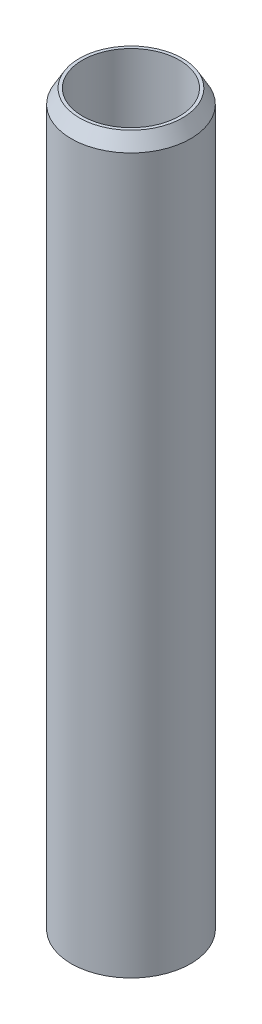
ISO-10303-21;
HEADER;
FILE_DESCRIPTION(('STEP AP214'),'2;1');
FILE_NAME('part.step','',(''),(''),'','','');
FILE_SCHEMA(('AUTOMOTIVE_DESIGN { 1 0 10303 214 1 1 1 1 }'));
ENDSEC;
DATA;
#1=APPLICATION_CONTEXT('core data for automotive mechanical design processes');
#2=APPLICATION_PROTOCOL_DEFINITION('international standard','automotive_design',2000,#1);
#3=PRODUCT_CONTEXT('',#1,'mechanical');
#4=PRODUCT('Part','Part','',(#3));
#5=PRODUCT_RELATED_PRODUCT_CATEGORY('part','',(#4));
#6=PRODUCT_DEFINITION_FORMATION('','',#4);
#7=PRODUCT_DEFINITION_CONTEXT('part definition',#1,'design');
#8=PRODUCT_DEFINITION('design','',#6,#7);
#9=PRODUCT_DEFINITION_SHAPE('','',#8);
#10=(LENGTH_UNIT() NAMED_UNIT(*) SI_UNIT(.MILLI.,.METRE.));
#11=(NAMED_UNIT(*) PLANE_ANGLE_UNIT() SI_UNIT($,.RADIAN.));
#12=(NAMED_UNIT(*) SI_UNIT($,.STERADIAN.) SOLID_ANGLE_UNIT());
#13=UNCERTAINTY_MEASURE_WITH_UNIT(LENGTH_MEASURE(1.E-05),#10,'distance_accuracy_value','');
#14=(GEOMETRIC_REPRESENTATION_CONTEXT(3) GLOBAL_UNCERTAINTY_ASSIGNED_CONTEXT((#13)) GLOBAL_UNIT_ASSIGNED_CONTEXT((#10,
#11,#12)) REPRESENTATION_CONTEXT('',''));
#15=CARTESIAN_POINT('',(0.,0.,0.));
#16=DIRECTION('',(0.,0.,1.));
#17=DIRECTION('',(1.,0.,0.));
#18=AXIS2_PLACEMENT_3D('',#15,#16,#17);
#19=CARTESIAN_POINT('',(0.,308.600417904735,0.));
#20=DIRECTION('',(0.,-1.,0.));
#21=DIRECTION('',(0.,0.,-1.));
#22=AXIS2_PLACEMENT_3D('',#19,#20,#21);
#23=CYLINDRICAL_SURFACE('',#22,25.);
#24=CARTESIAN_POINT('',(0.,302.728445459216,0.));
#25=DIRECTION('',(0.,1.,0.));
#26=DIRECTION('',(0.,0.,1.));
#27=AXIS2_PLACEMENT_3D('',#24,#25,#26);
#28=CIRCLE('',#27,25.);
#29=CARTESIAN_POINT('',(0.,302.728445459216,25.));
#30=VERTEX_POINT('',#29);
#31=EDGE_CURVE('E50',#30,#30,#28,.F.);
#32=ORIENTED_EDGE('',*,*,#31,.T.);
#33=EDGE_LOOP('',(#32));
#34=FACE_BOUND('',#33,.T.);
#35=CARTESIAN_POINT('',(0.,3.39018487209475,0.));
#36=DIRECTION('',(0.,1.,0.));
#37=DIRECTION('',(0.,0.,1.));
#38=AXIS2_PLACEMENT_3D('',#35,#36,#37);
#39=CIRCLE('',#38,25.);
#40=CARTESIAN_POINT('',(0.,3.39018487209475,25.));
#41=VERTEX_POINT('',#40);
#42=EDGE_CURVE('E51',#41,#41,#39,.T.);
#43=ORIENTED_EDGE('',*,*,#42,.T.);
#44=EDGE_LOOP('',(#43));
#45=FACE_BOUND('',#44,.T.);
#46=ADVANCED_FACE('F39',(#34,#45),#23,.T.);
#47=CARTESIAN_POINT('',(0.,308.600417904735,0.));
#48=DIRECTION('',(0.,1.,0.));
#49=DIRECTION('',(0.,0.,1.));
#50=AXIS2_PLACEMENT_3D('',#47,#48,#49);
#51=PLANE('',#50);
#52=CARTESIAN_POINT('',(0.,308.600417904735,0.));
#53=DIRECTION('',(0.,1.,0.));
#54=DIRECTION('',(0.,0.,1.));
#55=AXIS2_PLACEMENT_3D('',#52,#53,#54);
#56=CIRCLE('',#55,21.6098151279053);
#57=CARTESIAN_POINT('',(0.,308.600417904735,21.6098151279053));
#58=VERTEX_POINT('',#57);
#59=EDGE_CURVE('E54',#58,#58,#56,.T.);
#60=ORIENTED_EDGE('',*,*,#59,.T.);
#61=EDGE_LOOP('',(#60));
#62=FACE_BOUND('',#61,.T.);
#63=CARTESIAN_POINT('',(0.,308.600417904735,0.));
#64=DIRECTION('',(0.,1.,0.));
#65=DIRECTION('',(0.,0.,1.));
#66=AXIS2_PLACEMENT_3D('',#63,#64,#65);
#67=CIRCLE('',#66,20.3290881430263);
#68=CARTESIAN_POINT('',(0.,308.600417904735,20.3290881430263));
#69=VERTEX_POINT('',#68);
#70=EDGE_CURVE('E58',#69,#69,#67,.T.);
#71=ORIENTED_EDGE('',*,*,#70,.F.);
#72=EDGE_LOOP('',(#71));
#73=FACE_BOUND('',#72,.T.);
#74=ADVANCED_FACE('F68',(#62,#73),#51,.T.);
#75=CARTESIAN_POINT('',(0.,308.600417904735,0.));
#76=DIRECTION('',(0.,-1.,0.));
#77=DIRECTION('',(0.,0.,-1.));
#78=AXIS2_PLACEMENT_3D('',#75,#76,#77);
#79=CYLINDRICAL_SURFACE('',#78,20.3290881430263);
#80=CARTESIAN_POINT('',(0.,0.693432654109931,0.));
#81=DIRECTION('',(0.,1.,0.));
#82=DIRECTION('',(0.,0.,1.));
#83=AXIS2_PLACEMENT_3D('',#80,#81,#82);
#84=CIRCLE('',#83,20.3290881430263);
#85=CARTESIAN_POINT('',(0.,0.693432654109931,20.3290881430263));
#86=VERTEX_POINT('',#85);
#87=EDGE_CURVE('E10',#86,#86,#84,.F.);
#88=ORIENTED_EDGE('',*,*,#87,.T.);
#89=EDGE_LOOP('',(#88));
#90=FACE_BOUND('',#89,.T.);
#91=ORIENTED_EDGE('',*,*,#70,.T.);
#92=EDGE_LOOP('',(#91));
#93=FACE_BOUND('',#92,.T.);
#94=ADVANCED_FACE('F62',(#90,#93),#79,.F.);
#95=CARTESIAN_POINT('',(0.,308.600417904735,0.));
#96=DIRECTION('',(0.,-1.,0.));
#97=DIRECTION('',(0.,0.,-1.));
#98=AXIS2_PLACEMENT_3D('',#95,#96,#97);
#99=CONICAL_SURFACE('',#98,21.6098151279053,0.523598775598292);
#100=ORIENTED_EDGE('',*,*,#31,.F.);
#101=EDGE_LOOP('',(#100));
#102=FACE_BOUND('',#101,.T.);
#103=ORIENTED_EDGE('',*,*,#59,.F.);
#104=EDGE_LOOP('',(#103));
#105=FACE_BOUND('',#104,.T.);
#106=ADVANCED_FACE('F74',(#102,#105),#99,.T.);
#107=CARTESIAN_POINT('',(0.,3.39018487209475,0.));
#108=DIRECTION('',(0.,1.,0.));
#109=DIRECTION('',(0.,0.,1.));
#110=AXIS2_PLACEMENT_3D('',#107,#108,#109);
#111=CONICAL_SURFACE('',#110,25.,1.0471975511966);
#112=ORIENTED_EDGE('',*,*,#87,.F.);
#113=EDGE_LOOP('',(#112));
#114=FACE_BOUND('',#113,.T.);
#115=ORIENTED_EDGE('',*,*,#42,.F.);
#116=EDGE_LOOP('',(#115));
#117=FACE_BOUND('',#116,.T.);
#118=ADVANCED_FACE('F45',(#114,#117),#111,.T.);
#119=CLOSED_SHELL('',(#46,#74,#94,#106,#118));
#120=MANIFOLD_SOLID_BREP('B2',#119);
#121=ADVANCED_BREP_SHAPE_REPRESENTATION('',(#18,#120),#14);
#122=SHAPE_DEFINITION_REPRESENTATION(#9,#121);
ENDSEC;
END-ISO-10303-21;
